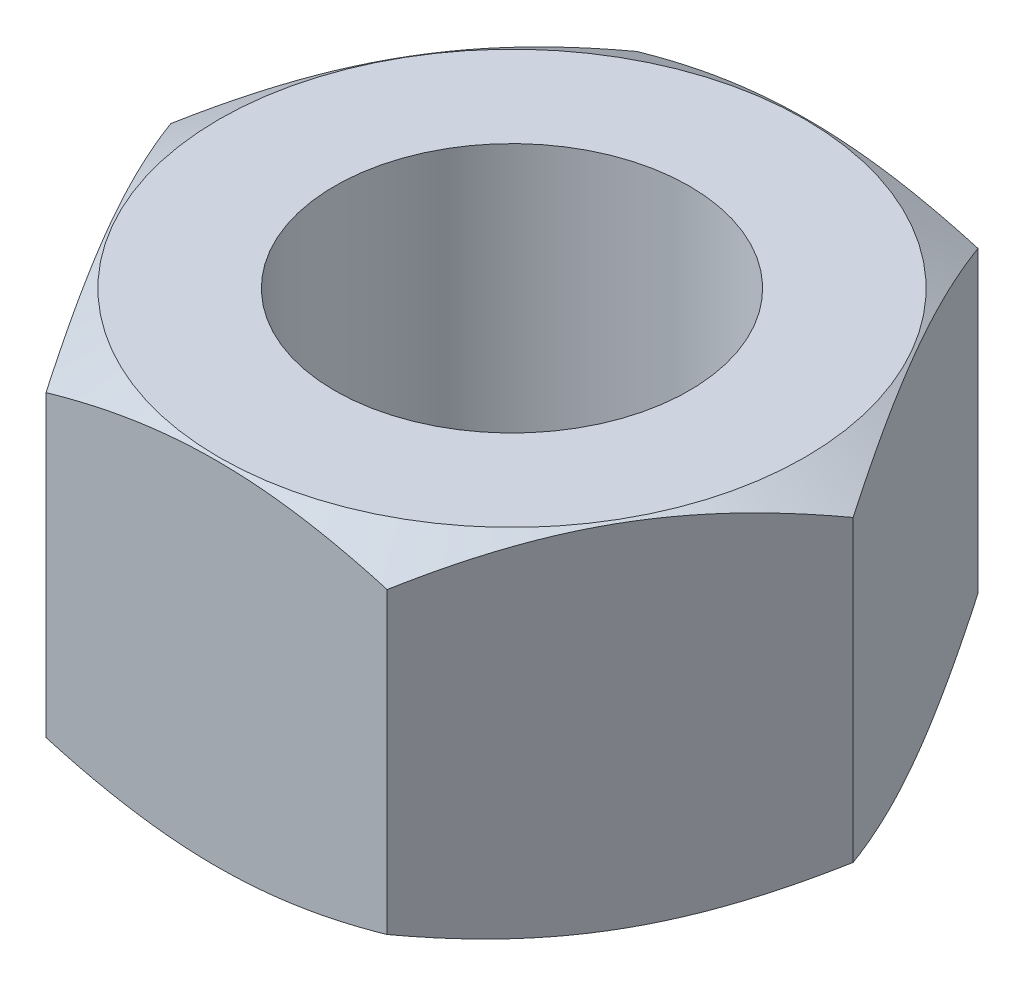
ISO-10303-21;
HEADER;
FILE_DESCRIPTION(('STEP AP214'),'2;1');
FILE_NAME('part.step','',(''),(''),'','','');
FILE_SCHEMA(('AUTOMOTIVE_DESIGN { 1 0 10303 214 1 1 1 1 }'));
ENDSEC;
DATA;
#1=APPLICATION_CONTEXT('core data for automotive mechanical design processes');
#2=APPLICATION_PROTOCOL_DEFINITION('international standard','automotive_design',2000,#1);
#3=PRODUCT_CONTEXT('',#1,'mechanical');
#4=PRODUCT('Part','Part','',(#3));
#5=PRODUCT_RELATED_PRODUCT_CATEGORY('part','',(#4));
#6=PRODUCT_DEFINITION_FORMATION('','',#4);
#7=PRODUCT_DEFINITION_CONTEXT('part definition',#1,'design');
#8=PRODUCT_DEFINITION('design','',#6,#7);
#9=PRODUCT_DEFINITION_SHAPE('','',#8);
#10=(LENGTH_UNIT() NAMED_UNIT(*) SI_UNIT(.MILLI.,.METRE.));
#11=(NAMED_UNIT(*) PLANE_ANGLE_UNIT() SI_UNIT($,.RADIAN.));
#12=(NAMED_UNIT(*) SI_UNIT($,.STERADIAN.) SOLID_ANGLE_UNIT());
#13=UNCERTAINTY_MEASURE_WITH_UNIT(LENGTH_MEASURE(1.E-05),#10,'distance_accuracy_value','');
#14=(GEOMETRIC_REPRESENTATION_CONTEXT(3) GLOBAL_UNCERTAINTY_ASSIGNED_CONTEXT((#13)) GLOBAL_UNIT_ASSIGNED_CONTEXT((#10,
#11,#12)) REPRESENTATION_CONTEXT('',''));
#15=CARTESIAN_POINT('',(0.,0.,0.));
#16=DIRECTION('',(0.,0.,1.));
#17=DIRECTION('',(1.,0.,0.));
#18=AXIS2_PLACEMENT_3D('',#15,#16,#17);
#19=CARTESIAN_POINT('',(0.,4.5,0.));
#20=DIRECTION('',(0.,1.,0.));
#21=DIRECTION('',(0.,0.,1.));
#22=AXIS2_PLACEMENT_3D('',#19,#20,#21);
#23=PLANE('',#22);
#24=CARTESIAN_POINT('',(0.,4.5,0.));
#25=DIRECTION('',(0.,1.,0.));
#26=DIRECTION('',(0.,0.,1.));
#27=AXIS2_PLACEMENT_3D('',#24,#25,#26);
#28=CIRCLE('',#27,7.4341359516973);
#29=CARTESIAN_POINT('',(0.,4.5,7.4341359516973));
#30=VERTEX_POINT('',#29);
#31=EDGE_CURVE('E204',#30,#30,#28,.F.);
#32=ORIENTED_EDGE('',*,*,#31,.F.);
#33=EDGE_LOOP('',(#32));
#34=FACE_BOUND('',#33,.T.);
#35=CARTESIAN_POINT('',(0.,4.5,0.));
#36=DIRECTION('',(0.,1.,0.));
#37=DIRECTION('',(0.,0.,1.));
#38=AXIS2_PLACEMENT_3D('',#35,#36,#37);
#39=CIRCLE('',#38,4.5);
#40=CARTESIAN_POINT('',(0.,4.5,4.5));
#41=VERTEX_POINT('',#40);
#42=EDGE_CURVE('E111',#41,#41,#39,.T.);
#43=ORIENTED_EDGE('',*,*,#42,.F.);
#44=EDGE_LOOP('',(#43));
#45=FACE_BOUND('',#44,.T.);
#46=ADVANCED_FACE('F33',(#34,#45),#23,.T.);
#47=CARTESIAN_POINT('',(0.,-4.5,0.));
#48=DIRECTION('',(0.,1.,0.));
#49=DIRECTION('',(0.,0.,1.));
#50=AXIS2_PLACEMENT_3D('',#47,#48,#49);
#51=PLANE('',#50);
#52=CARTESIAN_POINT('',(0.,-4.5,0.));
#53=DIRECTION('',(0.,1.,0.));
#54=DIRECTION('',(0.,0.,1.));
#55=AXIS2_PLACEMENT_3D('',#52,#53,#54);
#56=CIRCLE('',#55,7.4341359516973);
#57=CARTESIAN_POINT('',(0.,-4.5,7.4341359516973));
#58=VERTEX_POINT('',#57);
#59=EDGE_CURVE('E237',#58,#58,#56,.F.);
#60=ORIENTED_EDGE('',*,*,#59,.T.);
#61=EDGE_LOOP('',(#60));
#62=FACE_BOUND('',#61,.T.);
#63=CARTESIAN_POINT('',(0.,-4.5,0.));
#64=DIRECTION('',(0.,1.,0.));
#65=DIRECTION('',(0.,0.,1.));
#66=AXIS2_PLACEMENT_3D('',#63,#64,#65);
#67=CIRCLE('',#66,4.5);
#68=CARTESIAN_POINT('',(0.,-4.5,4.5));
#69=VERTEX_POINT('',#68);
#70=EDGE_CURVE('E207',#69,#69,#67,.T.);
#71=ORIENTED_EDGE('',*,*,#70,.T.);
#72=EDGE_LOOP('',(#71));
#73=FACE_BOUND('',#72,.T.);
#74=ADVANCED_FACE('F134',(#62,#73),#51,.F.);
#75=CARTESIAN_POINT('',(4.3301270189222,4.5,7.5));
#76=DIRECTION('',(-0.866025403784439,0.,-0.5));
#77=DIRECTION('',(-0.5,0.,0.866025403784439));
#78=AXIS2_PLACEMENT_3D('',#75,#76,#77);
#79=PLANE('',#78);
#80=DIRECTION('',(0.,-1.,0.));
#81=VECTOR('',#80,1.);
#82=CARTESIAN_POINT('',(4.3301270189222,4.5,7.5));
#83=LINE('',#82,#81);
#84=CARTESIAN_POINT('',(4.3301270189222,3.79210039290472,7.5));
#85=VERTEX_POINT('',#84);
#86=CARTESIAN_POINT('',(4.3301270189222,-3.79210039290472,7.5));
#87=VERTEX_POINT('',#86);
#88=EDGE_CURVE('E107',#85,#87,#83,.T.);
#89=ORIENTED_EDGE('',*,*,#88,.T.);
#90=CARTESIAN_POINT('',(4.33001154886836,-3.79203372490474,7.5002));
#91=CARTESIAN_POINT('',(4.42519256019198,-3.84697810293629,7.33534165247169));
#92=CARTESIAN_POINT('',(4.52072845228185,-3.89942888656319,7.16986863342562));
#93=CARTESIAN_POINT('',(4.71257608940913,-3.99865648145022,6.83757877860914));
#94=CARTESIAN_POINT('',(4.80888815017643,-4.04543084503664,6.67076139597852));
#95=CARTESIAN_POINT('',(5.099366398521,-4.17632119073135,6.16763831135212));
#96=CARTESIAN_POINT('',(5.29467919910788,-4.25077006730594,5.82934661736707));
#97=CARTESIAN_POINT('',(5.58696124946557,-4.3380700447163,5.32309925600715));
#98=CARTESIAN_POINT('',(5.68305719959877,-4.36293926066098,5.15665618797484));
#99=CARTESIAN_POINT('',(5.87568330162105,-4.40464125970851,4.8230179924083));
#100=CARTESIAN_POINT('',(5.97221341438525,-4.42147475286836,4.65582293264035));
#101=CARTESIAN_POINT('',(6.16544128734746,-4.44667629990832,4.32114243923135));
#102=CARTESIAN_POINT('',(6.26213873196775,-4.45505396096233,4.15365755218693));
#103=CARTESIAN_POINT('',(6.45561760093149,-4.46317319300757,3.81854232095076));
#104=CARTESIAN_POINT('',(6.55239902258814,-4.46291503079938,3.65091198141271));
#105=CARTESIAN_POINT('',(6.81754700863524,-4.45033736884589,3.19166219805456));
#106=CARTESIAN_POINT('',(6.98582677359289,-4.42922370630183,2.90019309526216));
#107=CARTESIAN_POINT('',(7.32126860628432,-4.36227279524708,2.31919079805659));
#108=CARTESIAN_POINT('',(7.48842949437092,-4.31641266451977,2.02965964685226));
#109=CARTESIAN_POINT('',(7.82454637240611,-4.20177591753428,1.44748813681388));
#110=CARTESIAN_POINT('',(7.99345995192916,-4.13251360961334,1.15492123499163));
#111=CARTESIAN_POINT('',(8.3287681694481,-3.9753162214056,0.574150366053476));
#112=CARTESIAN_POINT('',(8.49516710145045,-3.88741806481412,0.285938961500202));
#113=CARTESIAN_POINT('',(8.66036950789823,-3.79203372490474,-0.000199999999993936));
#114=B_SPLINE_CURVE_WITH_KNOTS('',3,(#90,#91,#92,#93,#94,#95,#96,#97,#98,#99,#100,#101,#102,
#103,#104,#105,#106,#107,#108,#109,#110,#111,#112,#113),.UNSPECIFIED.,.F.,.F.,(4,2,2,2,2,2,2,2,
2,2,2,4),(0.,0.594350768035412,1.1889569164522,2.38063993230779,2.96188692500078,
3.54308254771241,4.12361709366647,4.70413370423531,5.7147367557813,6.7262758828811,
7.76024925314079,8.79219281633468),.UNSPECIFIED.);
#115=CARTESIAN_POINT('',(8.66025403784439,-3.79210039290472,0.));
#116=VERTEX_POINT('',#115);
#117=EDGE_CURVE('E54',#87,#116,#114,.T.);
#118=ORIENTED_EDGE('',*,*,#117,.T.);
#119=DIRECTION('',(0.,-1.,0.));
#120=VECTOR('',#119,1.);
#121=CARTESIAN_POINT('',(8.66025403784439,4.5,0.));
#122=LINE('',#121,#120);
#123=CARTESIAN_POINT('',(8.66025403784439,3.79210039290472,0.));
#124=VERTEX_POINT('',#123);
#125=EDGE_CURVE('E120',#124,#116,#122,.T.);
#126=ORIENTED_EDGE('',*,*,#125,.F.);
#127=CARTESIAN_POINT('',(8.66036950789823,3.79203372490474,-0.000199999999994871));
#128=CARTESIAN_POINT('',(8.5651884965746,3.84697810293629,0.164658347528309));
#129=CARTESIAN_POINT('',(8.46965260448473,3.89942888656319,0.33013136657438));
#130=CARTESIAN_POINT('',(8.27780496735746,3.99865648145022,0.662421221390861));
#131=CARTESIAN_POINT('',(8.18149290659016,4.04543084503664,0.829238604021483));
#132=CARTESIAN_POINT('',(7.89101465824559,4.17632119073135,1.33236168864788));
#133=CARTESIAN_POINT('',(7.69570185765871,4.25077006730594,1.67065338263293));
#134=CARTESIAN_POINT('',(7.40341980730102,4.3380700447163,2.17690074399285));
#135=CARTESIAN_POINT('',(7.30732385716782,4.36293926066098,2.34334381202516));
#136=CARTESIAN_POINT('',(7.11469775514554,4.40464125970851,2.6769820075917));
#137=CARTESIAN_POINT('',(7.01816764238133,4.42147475286836,2.84417706735965));
#138=CARTESIAN_POINT('',(6.82493976941913,4.44667629990832,3.17885756076866));
#139=CARTESIAN_POINT('',(6.72824232479884,4.45505396096234,3.34634244781307));
#140=CARTESIAN_POINT('',(6.53476345583509,4.46317319300757,3.68145767904925));
#141=CARTESIAN_POINT('',(6.43798203417845,4.46291503079939,3.8490880185873));
#142=CARTESIAN_POINT('',(6.17283404813135,4.45033736884589,4.30833780194545));
#143=CARTESIAN_POINT('',(6.0045542831737,4.42922370630183,4.59980690473785));
#144=CARTESIAN_POINT('',(5.66911245048227,4.36227279524708,5.18080920194341));
#145=CARTESIAN_POINT('',(5.50195156239567,4.31641266451977,5.47034035314774));
#146=CARTESIAN_POINT('',(5.16583468436048,4.20177591753428,6.05251186318613));
#147=CARTESIAN_POINT('',(4.99692110483743,4.13251360961334,6.34507876500837));
#148=CARTESIAN_POINT('',(4.66161288731849,3.9753162214056,6.92584963394653));
#149=CARTESIAN_POINT('',(4.49521395531614,3.88741806481412,7.2140610384998));
#150=CARTESIAN_POINT('',(4.33001154886836,3.79203372490474,7.5002));
#151=B_SPLINE_CURVE_WITH_KNOTS('',3,(#127,#128,#129,#130,#131,#132,#133,#134,#135,#136,#137,
#138,#139,#140,#141,#142,#143,#144,#145,#146,#147,#148,#149,#150),.UNSPECIFIED.,.F.,.F.,(4,2,2,
2,2,2,2,2,2,2,2,4),(0.,0.594350768035412,1.1889569164522,2.38063993230779,2.96188692500078,
3.54308254771241,4.12361709366647,4.70413370423531,5.7147367557813,6.7262758828811,
7.76024925314079,8.79219281633468),.UNSPECIFIED.);
#152=EDGE_CURVE('E194',#124,#85,#151,.T.);
#153=ORIENTED_EDGE('',*,*,#152,.T.);
#154=EDGE_LOOP('',(#89,#118,#126,#153));
#155=FACE_BOUND('',#154,.T.);
#156=ADVANCED_FACE('F35',(#155),#79,.F.);
#157=CARTESIAN_POINT('',(8.66025403784439,4.5,0.));
#158=DIRECTION('',(-0.866025403784438,0.,0.5));
#159=DIRECTION('',(0.5,0.,0.866025403784438));
#160=AXIS2_PLACEMENT_3D('',#157,#158,#159);
#161=PLANE('',#160);
#162=ORIENTED_EDGE('',*,*,#125,.T.);
#163=CARTESIAN_POINT('',(8.66036950789823,-3.79203372490473,0.000200000000005225));
#164=CARTESIAN_POINT('',(8.56518849657461,-3.84697810293629,-0.164658347528298));
#165=CARTESIAN_POINT('',(8.46965260448474,-3.89942888656319,-0.330131366574369));
#166=CARTESIAN_POINT('',(8.27780496735746,-3.99865648145022,-0.66242122139085));
#167=CARTESIAN_POINT('',(8.18149290659016,-4.04543084503664,-0.829238604021472));
#168=CARTESIAN_POINT('',(7.89101465824559,-4.17632119073135,-1.33236168864787));
#169=CARTESIAN_POINT('',(7.69570185765871,-4.25077006730595,-1.67065338263292));
#170=CARTESIAN_POINT('',(7.40341980730102,-4.3380700447163,-2.17690074399284));
#171=CARTESIAN_POINT('',(7.30732385716782,-4.36293926066098,-2.34334381202515));
#172=CARTESIAN_POINT('',(7.11469775514554,-4.40464125970851,-2.67698200759169));
#173=CARTESIAN_POINT('',(7.01816764238133,-4.42147475286837,-2.84417706735964));
#174=CARTESIAN_POINT('',(6.82493976941913,-4.44667629990832,-3.17885756076865));
#175=CARTESIAN_POINT('',(6.72824232479884,-4.45505396096234,-3.34634244781306));
#176=CARTESIAN_POINT('',(6.53476345583509,-4.46317319300758,-3.68145767904924));
#177=CARTESIAN_POINT('',(6.43798203417845,-4.46291503079939,-3.84908801858729));
#178=CARTESIAN_POINT('',(6.17283404813135,-4.4503373688459,-4.30833780194544));
#179=CARTESIAN_POINT('',(6.00455428317369,-4.42922370630183,-4.59980690473784));
#180=CARTESIAN_POINT('',(5.66911245048227,-4.36227279524709,-5.1808092019434));
#181=CARTESIAN_POINT('',(5.50195156239567,-4.31641266451978,-5.47034035314773));
#182=CARTESIAN_POINT('',(5.16583468436047,-4.20177591753428,-6.05251186318612));
#183=CARTESIAN_POINT('',(4.99692110483742,-4.13251360961334,-6.34507876500837));
#184=CARTESIAN_POINT('',(4.66161288731849,-3.9753162214056,-6.92584963394653));
#185=CARTESIAN_POINT('',(4.49521395531613,-3.88741806481413,-7.2140610384998));
#186=CARTESIAN_POINT('',(4.33001154886835,-3.79203372490474,-7.5002));
#187=B_SPLINE_CURVE_WITH_KNOTS('',3,(#163,#164,#165,#166,#167,#168,#169,#170,#171,#172,#173,
#174,#175,#176,#177,#178,#179,#180,#181,#182,#183,#184,#185,#186),.UNSPECIFIED.,.F.,.F.,(4,2,2,
2,2,2,2,2,2,2,2,4),(0.,0.594350768035412,1.1889569164522,2.38063993230779,2.96188692500078,
3.54308254771242,4.12361709366647,4.70413370423531,5.71473675578131,6.7262758828811,
7.7602492531408,8.7921928163347),.UNSPECIFIED.);
#188=CARTESIAN_POINT('',(4.33012701892219,-3.79210039290472,-7.5));
#189=VERTEX_POINT('',#188);
#190=EDGE_CURVE('E171',#116,#189,#187,.T.);
#191=ORIENTED_EDGE('',*,*,#190,.T.);
#192=DIRECTION('',(0.,-1.,0.));
#193=VECTOR('',#192,1.);
#194=CARTESIAN_POINT('',(4.33012701892219,4.5,-7.5));
#195=LINE('',#194,#193);
#196=CARTESIAN_POINT('',(4.33012701892219,3.79210039290472,-7.5));
#197=VERTEX_POINT('',#196);
#198=EDGE_CURVE('E117',#197,#189,#195,.T.);
#199=ORIENTED_EDGE('',*,*,#198,.F.);
#200=CARTESIAN_POINT('',(4.33001154886835,3.79203372490474,-7.5002));
#201=CARTESIAN_POINT('',(4.42519256019197,3.84697810293629,-7.3353416524717));
#202=CARTESIAN_POINT('',(4.52072845228184,3.8994288865632,-7.16986863342563));
#203=CARTESIAN_POINT('',(4.71257608940912,3.99865648145022,-6.83757877860914));
#204=CARTESIAN_POINT('',(4.80888815017642,4.04543084503664,-6.67076139597852));
#205=CARTESIAN_POINT('',(5.09936639852099,4.17632119073135,-6.16763831135212));
#206=CARTESIAN_POINT('',(5.29467919910787,4.25077006730595,-5.82934661736707));
#207=CARTESIAN_POINT('',(5.58696124946556,4.33807004471631,-5.32309925600715));
#208=CARTESIAN_POINT('',(5.68305719959876,4.36293926066098,-5.15665618797484));
#209=CARTESIAN_POINT('',(5.87568330162104,4.40464125970851,-4.82301799240831));
#210=CARTESIAN_POINT('',(5.97221341438524,4.42147475286837,-4.65582293264035));
#211=CARTESIAN_POINT('',(6.16544128734745,4.44667629990833,-4.32114243923135));
#212=CARTESIAN_POINT('',(6.26213873196774,4.45505396096234,-4.15365755218693));
#213=CARTESIAN_POINT('',(6.45561760093148,4.46317319300758,-3.81854232095076));
#214=CARTESIAN_POINT('',(6.55239902258813,4.46291503079939,-3.65091198141271));
#215=CARTESIAN_POINT('',(6.81754700863523,4.4503373688459,-3.19166219805456));
#216=CARTESIAN_POINT('',(6.98582677359288,4.42922370630183,-2.90019309526216));
#217=CARTESIAN_POINT('',(7.32126860628431,4.36227279524709,-2.31919079805659));
#218=CARTESIAN_POINT('',(7.48842949437091,4.31641266451978,-2.02965964685226));
#219=CARTESIAN_POINT('',(7.82454637240611,4.20177591753428,-1.44748813681387));
#220=CARTESIAN_POINT('',(7.99345995192916,4.13251360961334,-1.15492123499162));
#221=CARTESIAN_POINT('',(8.32876816944809,3.9753162214056,-0.574150366053468));
#222=CARTESIAN_POINT('',(8.49516710145045,3.88741806481412,-0.285938961500192));
#223=CARTESIAN_POINT('',(8.66036950789823,3.79203372490474,0.000200000000005035));
#224=B_SPLINE_CURVE_WITH_KNOTS('',3,(#200,#201,#202,#203,#204,#205,#206,#207,#208,#209,#210,
#211,#212,#213,#214,#215,#216,#217,#218,#219,#220,#221,#222,#223),.UNSPECIFIED.,.F.,.F.,(4,2,2,
2,2,2,2,2,2,2,2,4),(0.,0.594350768035412,1.1889569164522,2.38063993230779,2.96188692500078,
3.54308254771241,4.12361709366647,4.70413370423531,5.7147367557813,6.7262758828811,
7.7602492531408,8.7921928163347),.UNSPECIFIED.);
#225=EDGE_CURVE('E187',#197,#124,#224,.T.);
#226=ORIENTED_EDGE('',*,*,#225,.T.);
#227=EDGE_LOOP('',(#162,#191,#199,#226));
#228=FACE_BOUND('',#227,.T.);
#229=ADVANCED_FACE('F179',(#228),#161,.F.);
#230=CARTESIAN_POINT('',(4.33012701892219,4.5,-7.5));
#231=DIRECTION('',(0.,0.,1.));
#232=DIRECTION('',(1.,0.,0.));
#233=AXIS2_PLACEMENT_3D('',#230,#231,#232);
#234=PLANE('',#233);
#235=ORIENTED_EDGE('',*,*,#198,.T.);
#236=CARTESIAN_POINT('',(-11.5395924058814,-0.846195936438404,-7.5));
#237=CARTESIAN_POINT('',(-11.2127769642372,-1.00435992916208,-7.5));
#238=CARTESIAN_POINT('',(-10.8852013735051,-1.16098061428477,-7.5));
#239=CARTESIAN_POINT('',(-10.2281252758828,-1.47026548030183,-7.5));
#240=CARTESIAN_POINT('',(-9.89862446699821,-1.62292901887506,-7.5));
#241=CARTESIAN_POINT('',(-9.23555117525074,-1.92421750059593,-7.5));
#242=CARTESIAN_POINT('',(-8.90196622891297,-2.07281511097907,-7.5));
#243=CARTESIAN_POINT('',(-8.23211087262991,-2.36380543965907,-7.5));
#244=CARTESIAN_POINT('',(-7.89584059326197,-2.50619845751339,-7.5));
#245=CARTESIAN_POINT('',(-7.20958210730869,-2.78744038983469,-7.5));
#246=CARTESIAN_POINT('',(-6.85949204741581,-2.92604216989549,-7.5));
#247=CARTESIAN_POINT('',(-6.15518322737085,-3.19253212483412,-7.5));
#248=CARTESIAN_POINT('',(-5.80096400412197,-3.32041908458772,-7.5));
#249=CARTESIAN_POINT('',(-5.08852224391839,-3.56205426578386,-7.5));
#250=CARTESIAN_POINT('',(-4.73030980043322,-3.67583192223676,-7.5));
#251=CARTESIAN_POINT('',(-4.00876097959616,-3.8855389558614,-7.5));
#252=CARTESIAN_POINT('',(-3.64542628466288,-3.98147405301494,-7.5));
#253=CARTESIAN_POINT('',(-2.91536601033844,-4.15031982241968,-7.5));
#254=CARTESIAN_POINT('',(-2.54866930784728,-4.22335194276098,-7.5));
#255=CARTESIAN_POINT('',(-1.99535958061554,-4.3125162024176,-7.5));
#256=CARTESIAN_POINT('',(-1.81036456926675,-4.33884154012838,-7.5));
#257=CARTESIAN_POINT('',(-1.43948655345895,-4.38417925815019,-7.5));
#258=CARTESIAN_POINT('',(-1.25360363614891,-4.40319234181923,-7.5));
#259=CARTESIAN_POINT('',(-0.883586273494876,-4.43329302435465,-7.5));
#260=CARTESIAN_POINT('',(-0.699459845505899,-4.44447881264385,-7.5));
#261=CARTESIAN_POINT('',(-0.33089933388193,-4.45906070729381,-7.5));
#262=CARTESIAN_POINT('',(-0.146465255285703,-4.46245694000396,-7.5));
#263=CARTESIAN_POINT('',(0.222381927440417,-4.46137889311918,-7.5));
#264=CARTESIAN_POINT('',(0.406795031436095,-4.45690456571466,-7.5));
#265=CARTESIAN_POINT('',(0.775271642923434,-4.44019310454552,-7.5));
#266=CARTESIAN_POINT('',(0.959335131699971,-4.42795556633876,-7.5));
#267=CARTESIAN_POINT('',(1.40452016722755,-4.38922457185199,-7.5));
#268=CARTESIAN_POINT('',(1.66531438699297,-4.35889107931952,-7.5));
#269=CARTESIAN_POINT('',(2.18489408576868,-4.28431600218544,-7.5));
#270=CARTESIAN_POINT('',(2.44367927487946,-4.24007244725284,-7.5));
#271=CARTESIAN_POINT('',(3.2167670857175,-4.08882909832201,-7.5));
#272=CARTESIAN_POINT('',(3.72749758329527,-3.9633465312742,-7.5));
#273=CARTESIAN_POINT('',(4.49104327969545,-3.74667709173858,-7.5));
#274=CARTESIAN_POINT('',(4.74784210933529,-3.66872900781551,-7.5));
#275=CARTESIAN_POINT('',(5.25894422295974,-3.50496790450674,-7.5));
#276=CARTESIAN_POINT('',(5.5132474909373,-3.41915483470991,-7.5));
#277=CARTESIAN_POINT('',(6.01944286002732,-3.24102125477352,-7.5));
#278=CARTESIAN_POINT('',(6.27133577768172,-3.14870304388596,-7.5));
#279=CARTESIAN_POINT('',(6.77305045823042,-2.95862226308785,-7.5));
#280=CARTESIAN_POINT('',(7.02287224113362,-2.86085974584442,-7.5));
#281=CARTESIAN_POINT('',(7.59417450290957,-2.63126038399901,-7.5));
#282=CARTESIAN_POINT('',(7.91503538642881,-2.49788506028777,-7.5));
#283=CARTESIAN_POINT('',(8.55417556394399,-2.22507020094293,-7.5));
#284=CARTESIAN_POINT('',(8.87245472675068,-2.08563035940515,-7.5));
#285=CARTESIAN_POINT('',(9.50688911121455,-1.8018520856645,-7.5));
#286=CARTESIAN_POINT('',(9.82304391592479,-1.6575127236448,-7.5));
#287=CARTESIAN_POINT('',(10.4535087877737,-1.36488197517741,-7.5));
#288=CARTESIAN_POINT('',(10.7678188847199,-1.21659065280264,-7.5));
#289=CARTESIAN_POINT('',(11.395171445629,-0.916632382376871,-7.5));
#290=CARTESIAN_POINT('',(11.7082125042594,-0.764962499660067,-7.5));
#291=CARTESIAN_POINT('',(12.3329778714164,-0.458932312232355,-7.5));
#292=CARTESIAN_POINT('',(12.644702168638,-0.304571984481096,-7.5));
#293=CARTESIAN_POINT('',(13.5782167134934,0.161861064968362,-7.5));
#294=CARTESIAN_POINT('',(14.1983359239781,0.477279737819667,-7.5));
#295=CARTESIAN_POINT('',(15.1015948839471,0.942577635458164,-7.5));
#296=CARTESIAN_POINT('',(15.3860321019372,1.08995381902805,-7.5));
#297=CARTESIAN_POINT('',(15.9542869447692,1.38588525845685,-7.5));
#298=CARTESIAN_POINT('',(16.238104580233,1.53444049389677,-7.5));
#299=CARTESIAN_POINT('',(17.0887723203144,1.98165026042697,-7.5));
#300=CARTESIAN_POINT('',(17.6548162949906,2.28183802298298,-7.5));
#301=CARTESIAN_POINT('',(18.7839520512125,2.8846669586119,-7.5));
#302=CARTESIAN_POINT('',(19.3470476124426,3.18730106478019,-7.5));
#303=CARTESIAN_POINT('',(20.471864823661,3.79504578027235,-7.5));
#304=CARTESIAN_POINT('',(21.0335865411291,4.10015626464935,-7.5));
#305=CARTESIAN_POINT('',(21.594797047145,4.40619822860168,-7.5));
#306=B_SPLINE_CURVE_WITH_KNOTS('',3,(#236,#237,#238,#239,#240,#241,#242,#243,#244,#245,#246,
#247,#248,#249,#250,#251,#252,#253,#254,#255,#256,#257,#258,#259,#260,#261,#262,#263,#264,#265,
#266,#267,#268,#269,#270,#271,#272,#273,#274,#275,#276,#277,#278,#279,#280,#281,#282,#283,#284,
#285,#286,#287,#288,#289,#290,#291,#292,#293,#294,#295,#296,#297,#298,#299,#300,#301,#302,#303,
#304,#305),.UNSPECIFIED.,.F.,.F.,(4,2,2,2,2,2,2,2,2,2,2,2,2,2,2,2,2,2,2,2,2,2,2,2,2,2,2,2,2,2,2,
2,2,2,4),(0.,1.08924175143649,2.17865921444465,3.2741639744668,4.36961578482893,
5.49906443786425,6.6286410041974,7.75581990553287,8.88263682974859,10.003373366933,
10.5638276698733,11.1242280498134,11.6774659778012,12.2306949320075,12.783927246806,
13.337188385869,14.1243987026943,14.9117205764773,16.4872777313753,17.2923185532113,
18.0973645353688,18.9021273864406,19.7068824537535,20.7492331837171,21.7916365526693,
22.8342388642404,23.8768242824306,24.9203536359842,25.9638919304776,28.0510107755432,
29.0120605225308,29.9730936620707,31.8952307249398,33.8130293296857,35.7307317651679),.UNSPECIFIED.);
#307=CARTESIAN_POINT('',(-4.33012701892219,-3.79210039290472,-7.5));
#308=VERTEX_POINT('',#307);
#309=EDGE_CURVE('E166',#189,#308,#306,.F.);
#310=ORIENTED_EDGE('',*,*,#309,.T.);
#311=DIRECTION('',(0.,-1.,0.));
#312=VECTOR('',#311,1.);
#313=CARTESIAN_POINT('',(-4.33012701892219,4.5,-7.5));
#314=LINE('',#313,#312);
#315=CARTESIAN_POINT('',(-4.33012701892219,3.79210039290472,-7.5));
#316=VERTEX_POINT('',#315);
#317=EDGE_CURVE('E109',#316,#308,#314,.T.);
#318=ORIENTED_EDGE('',*,*,#317,.F.);
#319=CARTESIAN_POINT('',(-11.5395924058814,0.846195936438405,-7.5));
#320=CARTESIAN_POINT('',(-11.2127769642372,1.00435992916208,-7.5));
#321=CARTESIAN_POINT('',(-10.8852013735051,1.16098061428477,-7.5));
#322=CARTESIAN_POINT('',(-10.2281252758828,1.47026548030183,-7.5));
#323=CARTESIAN_POINT('',(-9.8986244669982,1.62292901887507,-7.5));
#324=CARTESIAN_POINT('',(-9.23555117525074,1.92421750059593,-7.5));
#325=CARTESIAN_POINT('',(-8.90196622891296,2.07281511097907,-7.5));
#326=CARTESIAN_POINT('',(-8.2321108726299,2.36380543965907,-7.5));
#327=CARTESIAN_POINT('',(-7.89584059326197,2.50619845751339,-7.5));
#328=CARTESIAN_POINT('',(-7.20958210730868,2.78744038983469,-7.5));
#329=CARTESIAN_POINT('',(-6.85949204741581,2.92604216989549,-7.5));
#330=CARTESIAN_POINT('',(-6.15518322737085,3.19253212483412,-7.5));
#331=CARTESIAN_POINT('',(-5.80096400412197,3.32041908458772,-7.5));
#332=CARTESIAN_POINT('',(-5.08852224391839,3.56205426578386,-7.5));
#333=CARTESIAN_POINT('',(-4.73030980043322,3.67583192223676,-7.5));
#334=CARTESIAN_POINT('',(-4.00876097959616,3.8855389558614,-7.5));
#335=CARTESIAN_POINT('',(-3.64542628466288,3.98147405301494,-7.5));
#336=CARTESIAN_POINT('',(-2.91536601033844,4.15031982241968,-7.5));
#337=CARTESIAN_POINT('',(-2.54866930784728,4.22335194276099,-7.5));
#338=CARTESIAN_POINT('',(-1.99535958061554,4.3125162024176,-7.5));
#339=CARTESIAN_POINT('',(-1.81036456926675,4.33884154012838,-7.5));
#340=CARTESIAN_POINT('',(-1.43948655345894,4.38417925815019,-7.5));
#341=CARTESIAN_POINT('',(-1.25360363614891,4.40319234181923,-7.5));
#342=CARTESIAN_POINT('',(-0.883586273494875,4.43329302435465,-7.5));
#343=CARTESIAN_POINT('',(-0.699459845505898,4.44447881264385,-7.5));
#344=CARTESIAN_POINT('',(-0.330899333881929,4.45906070729381,-7.5));
#345=CARTESIAN_POINT('',(-0.146465255285703,4.46245694000396,-7.5));
#346=CARTESIAN_POINT('',(0.222381927440416,4.46137889311918,-7.5));
#347=CARTESIAN_POINT('',(0.406795031436094,4.45690456571466,-7.5));
#348=CARTESIAN_POINT('',(0.775271642923433,4.44019310454552,-7.5));
#349=CARTESIAN_POINT('',(0.95933513169997,4.42795556633876,-7.5));
#350=CARTESIAN_POINT('',(1.40452016722755,4.38922457185199,-7.5));
#351=CARTESIAN_POINT('',(1.66531438699297,4.35889107931952,-7.5));
#352=CARTESIAN_POINT('',(2.18489408576868,4.28431600218545,-7.5));
#353=CARTESIAN_POINT('',(2.44367927487945,4.24007244725284,-7.5));
#354=CARTESIAN_POINT('',(3.2167670857175,4.08882909832201,-7.5));
#355=CARTESIAN_POINT('',(3.72749758329527,3.9633465312742,-7.5));
#356=CARTESIAN_POINT('',(4.49104327969544,3.74667709173858,-7.5));
#357=CARTESIAN_POINT('',(4.74784210933529,3.66872900781551,-7.5));
#358=CARTESIAN_POINT('',(5.25894422295973,3.50496790450674,-7.5));
#359=CARTESIAN_POINT('',(5.5132474909373,3.41915483470991,-7.5));
#360=CARTESIAN_POINT('',(6.01944286002732,3.24102125477353,-7.5));
#361=CARTESIAN_POINT('',(6.27133577768172,3.14870304388596,-7.5));
#362=CARTESIAN_POINT('',(6.77305045823042,2.95862226308785,-7.5));
#363=CARTESIAN_POINT('',(7.02287224113361,2.86085974584443,-7.5));
#364=CARTESIAN_POINT('',(7.59417450290956,2.63126038399901,-7.5));
#365=CARTESIAN_POINT('',(7.91503538642881,2.49788506028777,-7.5));
#366=CARTESIAN_POINT('',(8.55417556394399,2.22507020094293,-7.5));
#367=CARTESIAN_POINT('',(8.87245472675068,2.08563035940516,-7.5));
#368=CARTESIAN_POINT('',(9.50688911121454,1.8018520856645,-7.5));
#369=CARTESIAN_POINT('',(9.82304391592478,1.6575127236448,-7.5));
#370=CARTESIAN_POINT('',(10.4535087877737,1.36488197517742,-7.5));
#371=CARTESIAN_POINT('',(10.7678188847199,1.21659065280265,-7.5));
#372=CARTESIAN_POINT('',(11.395171445629,0.916632382376875,-7.5));
#373=CARTESIAN_POINT('',(11.7082125042594,0.764962499660071,-7.5));
#374=CARTESIAN_POINT('',(12.3329778714164,0.458932312232359,-7.5));
#375=CARTESIAN_POINT('',(12.644702168638,0.3045719844811,-7.5));
#376=CARTESIAN_POINT('',(13.5782167134934,-0.161861064968358,-7.5));
#377=CARTESIAN_POINT('',(14.1983359239781,-0.477279737819662,-7.5));
#378=CARTESIAN_POINT('',(15.1015948839471,-0.942577635458158,-7.5));
#379=CARTESIAN_POINT('',(15.3860321019372,-1.08995381902804,-7.5));
#380=CARTESIAN_POINT('',(15.9542869447692,-1.38588525845685,-7.5));
#381=CARTESIAN_POINT('',(16.238104580233,-1.53444049389676,-7.5));
#382=CARTESIAN_POINT('',(17.0887723203144,-1.98165026042697,-7.5));
#383=CARTESIAN_POINT('',(17.6548162949906,-2.28183802298297,-7.5));
#384=CARTESIAN_POINT('',(18.7839520512125,-2.88466695861189,-7.5));
#385=CARTESIAN_POINT('',(19.3470476124426,-3.18730106478018,-7.5));
#386=CARTESIAN_POINT('',(20.471864823661,-3.79504578027235,-7.5));
#387=CARTESIAN_POINT('',(21.0335865411291,-4.10015626464935,-7.5));
#388=CARTESIAN_POINT('',(21.594797047145,-4.40619822860167,-7.5));
#389=B_SPLINE_CURVE_WITH_KNOTS('',3,(#319,#320,#321,#322,#323,#324,#325,#326,#327,#328,#329,
#330,#331,#332,#333,#334,#335,#336,#337,#338,#339,#340,#341,#342,#343,#344,#345,#346,#347,#348,
#349,#350,#351,#352,#353,#354,#355,#356,#357,#358,#359,#360,#361,#362,#363,#364,#365,#366,#367,
#368,#369,#370,#371,#372,#373,#374,#375,#376,#377,#378,#379,#380,#381,#382,#383,#384,#385,#386,
#387,#388),.UNSPECIFIED.,.F.,.F.,(4,2,2,2,2,2,2,2,2,2,2,2,2,2,2,2,2,2,2,2,2,2,2,2,2,2,2,2,2,2,2,
2,2,2,4),(0.,1.08924175143649,2.17865921444465,3.2741639744668,4.36961578482893,
5.49906443786425,6.6286410041974,7.75581990553286,8.88263682974859,10.003373366933,
10.5638276698733,11.1242280498134,11.6774659778012,12.2306949320075,12.783927246806,
13.337188385869,14.1243987026943,14.9117205764773,16.4872777313753,17.2923185532113,
18.0973645353688,18.9021273864406,19.7068824537535,20.7492331837171,21.7916365526693,
22.8342388642404,23.8768242824306,24.9203536359842,25.9638919304776,28.0510107755431,
29.0120605225308,29.9730936620707,31.8952307249398,33.8130293296857,35.7307317651679),.UNSPECIFIED.);
#390=EDGE_CURVE('E195',#316,#197,#389,.T.);
#391=ORIENTED_EDGE('',*,*,#390,.T.);
#392=EDGE_LOOP('',(#235,#310,#318,#391));
#393=FACE_BOUND('',#392,.T.);
#394=ADVANCED_FACE('F182',(#393),#234,.F.);
#395=CARTESIAN_POINT('',(-4.33012701892219,4.5,-7.5));
#396=DIRECTION('',(0.866025403784438,0.,0.5));
#397=DIRECTION('',(0.5,0.,-0.866025403784439));
#398=AXIS2_PLACEMENT_3D('',#395,#396,#397);
#399=PLANE('',#398);
#400=ORIENTED_EDGE('',*,*,#317,.T.);
#401=CARTESIAN_POINT('',(-4.33001154886835,-3.79203372490474,-7.5002));
#402=CARTESIAN_POINT('',(-4.42519256019198,-3.84697810293629,-7.3353416524717));
#403=CARTESIAN_POINT('',(-4.52072845228185,-3.89942888656319,-7.16986863342563));
#404=CARTESIAN_POINT('',(-4.71257608940912,-3.99865648145022,-6.83757877860915));
#405=CARTESIAN_POINT('',(-4.80888815017642,-4.04543084503664,-6.67076139597852));
#406=CARTESIAN_POINT('',(-5.09936639852099,-4.17632119073135,-6.16763831135212));
#407=CARTESIAN_POINT('',(-5.29467919910787,-4.25077006730595,-5.82934661736707));
#408=CARTESIAN_POINT('',(-5.58696124946556,-4.3380700447163,-5.32309925600715));
#409=CARTESIAN_POINT('',(-5.68305719959876,-4.36293926066098,-5.15665618797484));
#410=CARTESIAN_POINT('',(-5.87568330162104,-4.40464125970851,-4.82301799240831));
#411=CARTESIAN_POINT('',(-5.97221341438525,-4.42147475286837,-4.65582293264035));
#412=CARTESIAN_POINT('',(-6.16544128734745,-4.44667629990832,-4.32114243923135));
#413=CARTESIAN_POINT('',(-6.26213873196774,-4.45505396096234,-4.15365755218693));
#414=CARTESIAN_POINT('',(-6.45561760093149,-4.46317319300757,-3.81854232095076));
#415=CARTESIAN_POINT('',(-6.55239902258813,-4.46291503079939,-3.65091198141271));
#416=CARTESIAN_POINT('',(-6.81754700863523,-4.4503373688459,-3.19166219805456));
#417=CARTESIAN_POINT('',(-6.98582677359289,-4.42922370630183,-2.90019309526216));
#418=CARTESIAN_POINT('',(-7.32126860628431,-4.36227279524709,-2.31919079805659));
#419=CARTESIAN_POINT('',(-7.48842949437091,-4.31641266451978,-2.02965964685226));
#420=CARTESIAN_POINT('',(-7.82454637240611,-4.20177591753428,-1.44748813681388));
#421=CARTESIAN_POINT('',(-7.99345995192916,-4.13251360961334,-1.15492123499163));
#422=CARTESIAN_POINT('',(-8.32876816944809,-3.9753162214056,-0.574150366053472));
#423=CARTESIAN_POINT('',(-8.49516710145045,-3.88741806481412,-0.285938961500197));
#424=CARTESIAN_POINT('',(-8.66036950789822,-3.79203372490474,0.000199999999998916));
#425=B_SPLINE_CURVE_WITH_KNOTS('',3,(#401,#402,#403,#404,#405,#406,#407,#408,#409,#410,#411,
#412,#413,#414,#415,#416,#417,#418,#419,#420,#421,#422,#423,#424),.UNSPECIFIED.,.F.,.F.,(4,2,2,
2,2,2,2,2,2,2,2,4),(0.,0.594350768035411,1.1889569164522,2.38063993230779,2.96188692500078,
3.54308254771241,4.12361709366647,4.70413370423531,5.7147367557813,6.7262758828811,
7.7602492531408,8.79219281633469),.UNSPECIFIED.);
#426=CARTESIAN_POINT('',(-8.66025403784439,-3.79210039290472,0.));
#427=VERTEX_POINT('',#426);
#428=EDGE_CURVE('E104',#308,#427,#425,.T.);
#429=ORIENTED_EDGE('',*,*,#428,.T.);
#430=DIRECTION('',(0.,-1.,0.));
#431=VECTOR('',#430,1.);
#432=CARTESIAN_POINT('',(-8.66025403784439,4.5,0.));
#433=LINE('',#432,#431);
#434=CARTESIAN_POINT('',(-8.66025403784439,3.79210039290472,0.));
#435=VERTEX_POINT('',#434);
#436=EDGE_CURVE('E103',#435,#427,#433,.T.);
#437=ORIENTED_EDGE('',*,*,#436,.F.);
#438=CARTESIAN_POINT('',(-8.66036950789822,3.79203372490474,0.000199999999999369));
#439=CARTESIAN_POINT('',(-8.5651884965746,3.84697810293629,-0.164658347528305));
#440=CARTESIAN_POINT('',(-8.46965260448473,3.89942888656319,-0.330131366574375));
#441=CARTESIAN_POINT('',(-8.27780496735746,3.99865648145022,-0.662421221390857));
#442=CARTESIAN_POINT('',(-8.18149290659016,4.04543084503664,-0.829238604021478));
#443=CARTESIAN_POINT('',(-7.89101465824559,4.17632119073135,-1.33236168864788));
#444=CARTESIAN_POINT('',(-7.69570185765871,4.25077006730595,-1.67065338263293));
#445=CARTESIAN_POINT('',(-7.40341980730102,4.3380700447163,-2.17690074399285));
#446=CARTESIAN_POINT('',(-7.30732385716782,4.36293926066098,-2.34334381202516));
#447=CARTESIAN_POINT('',(-7.11469775514554,4.40464125970851,-2.67698200759169));
#448=CARTESIAN_POINT('',(-7.01816764238133,4.42147475286837,-2.84417706735965));
#449=CARTESIAN_POINT('',(-6.82493976941913,4.44667629990832,-3.17885756076865));
#450=CARTESIAN_POINT('',(-6.72824232479884,4.45505396096234,-3.34634244781307));
#451=CARTESIAN_POINT('',(-6.53476345583509,4.46317319300758,-3.68145767904924));
#452=CARTESIAN_POINT('',(-6.43798203417845,4.46291503079939,-3.84908801858729));
#453=CARTESIAN_POINT('',(-6.17283404813135,4.4503373688459,-4.30833780194544));
#454=CARTESIAN_POINT('',(-6.00455428317369,4.42922370630183,-4.59980690473784));
#455=CARTESIAN_POINT('',(-5.66911245048227,4.36227279524709,-5.18080920194341));
#456=CARTESIAN_POINT('',(-5.50195156239567,4.31641266451978,-5.47034035314774));
#457=CARTESIAN_POINT('',(-5.16583468436047,4.20177591753428,-6.05251186318613));
#458=CARTESIAN_POINT('',(-4.99692110483742,4.13251360961334,-6.34507876500837));
#459=CARTESIAN_POINT('',(-4.66161288731849,3.9753162214056,-6.92584963394653));
#460=CARTESIAN_POINT('',(-4.49521395531613,3.88741806481412,-7.2140610384998));
#461=CARTESIAN_POINT('',(-4.33001154886835,3.79203372490474,-7.5002));
#462=B_SPLINE_CURVE_WITH_KNOTS('',3,(#438,#439,#440,#441,#442,#443,#444,#445,#446,#447,#448,
#449,#450,#451,#452,#453,#454,#455,#456,#457,#458,#459,#460,#461),.UNSPECIFIED.,.F.,.F.,(4,2,2,
2,2,2,2,2,2,2,2,4),(0.,0.594350768035412,1.1889569164522,2.38063993230779,2.96188692500078,
3.54308254771241,4.12361709366647,4.70413370423531,5.7147367557813,6.7262758828811,
7.76024925314079,8.79219281633469),.UNSPECIFIED.);
#463=EDGE_CURVE('E235',#435,#316,#462,.T.);
#464=ORIENTED_EDGE('',*,*,#463,.T.);
#465=EDGE_LOOP('',(#400,#429,#437,#464));
#466=FACE_BOUND('',#465,.T.);
#467=ADVANCED_FACE('F140',(#466),#399,.F.);
#468=CARTESIAN_POINT('',(-8.66025403784439,4.5,0.));
#469=DIRECTION('',(0.866025403784439,0.,-0.5));
#470=DIRECTION('',(-0.5,0.,-0.866025403784439));
#471=AXIS2_PLACEMENT_3D('',#468,#469,#470);
#472=PLANE('',#471);
#473=ORIENTED_EDGE('',*,*,#436,.T.);
#474=CARTESIAN_POINT('',(-8.66036950789822,-3.79203372490474,-0.000200000000000836));
#475=CARTESIAN_POINT('',(-8.5651884965746,-3.84697810293629,0.164658347528303));
#476=CARTESIAN_POINT('',(-8.46965260448473,-3.89942888656319,0.330131366574374));
#477=CARTESIAN_POINT('',(-8.27780496735746,-3.99865648145022,0.662421221390855));
#478=CARTESIAN_POINT('',(-8.18149290659016,-4.04543084503664,0.829238604021477));
#479=CARTESIAN_POINT('',(-7.89101465824559,-4.17632119073135,1.33236168864788));
#480=CARTESIAN_POINT('',(-7.69570185765871,-4.25077006730595,1.67065338263293));
#481=CARTESIAN_POINT('',(-7.40341980730102,-4.3380700447163,2.17690074399285));
#482=CARTESIAN_POINT('',(-7.30732385716782,-4.36293926066098,2.34334381202516));
#483=CARTESIAN_POINT('',(-7.11469775514554,-4.40464125970851,2.67698200759169));
#484=CARTESIAN_POINT('',(-7.01816764238133,-4.42147475286837,2.84417706735965));
#485=CARTESIAN_POINT('',(-6.82493976941913,-4.44667629990832,3.17885756076865));
#486=CARTESIAN_POINT('',(-6.72824232479884,-4.45505396096234,3.34634244781307));
#487=CARTESIAN_POINT('',(-6.53476345583509,-4.46317319300757,3.68145767904924));
#488=CARTESIAN_POINT('',(-6.43798203417845,-4.46291503079939,3.84908801858729));
#489=CARTESIAN_POINT('',(-6.17283404813135,-4.4503373688459,4.30833780194544));
#490=CARTESIAN_POINT('',(-6.00455428317369,-4.42922370630183,4.59980690473784));
#491=CARTESIAN_POINT('',(-5.66911245048227,-4.36227279524708,5.18080920194341));
#492=CARTESIAN_POINT('',(-5.50195156239567,-4.31641266451978,5.47034035314774));
#493=CARTESIAN_POINT('',(-5.16583468436047,-4.20177591753428,6.05251186318612));
#494=CARTESIAN_POINT('',(-4.99692110483742,-4.13251360961334,6.34507876500837));
#495=CARTESIAN_POINT('',(-4.66161288731849,-3.9753162214056,6.92584963394653));
#496=CARTESIAN_POINT('',(-4.49521395531613,-3.88741806481412,7.2140610384998));
#497=CARTESIAN_POINT('',(-4.33001154886835,-3.79203372490474,7.5002));
#498=B_SPLINE_CURVE_WITH_KNOTS('',3,(#474,#475,#476,#477,#478,#479,#480,#481,#482,#483,#484,
#485,#486,#487,#488,#489,#490,#491,#492,#493,#494,#495,#496,#497),.UNSPECIFIED.,.F.,.F.,(4,2,2,
2,2,2,2,2,2,2,2,4),(0.,0.594350768035413,1.1889569164522,2.38063993230779,2.96188692500078,
3.54308254771242,4.12361709366647,4.70413370423531,5.7147367557813,6.7262758828811,
7.7602492531408,8.79219281633469),.UNSPECIFIED.);
#499=CARTESIAN_POINT('',(-4.33012701892219,-3.79210039290472,7.5));
#500=VERTEX_POINT('',#499);
#501=EDGE_CURVE('E91',#427,#500,#498,.T.);
#502=ORIENTED_EDGE('',*,*,#501,.T.);
#503=DIRECTION('',(0.,-1.,0.));
#504=VECTOR('',#503,1.);
#505=CARTESIAN_POINT('',(-4.33012701892219,4.5,7.5));
#506=LINE('',#505,#504);
#507=CARTESIAN_POINT('',(-4.33012701892219,3.79210039290472,7.5));
#508=VERTEX_POINT('',#507);
#509=EDGE_CURVE('E101',#508,#500,#506,.T.);
#510=ORIENTED_EDGE('',*,*,#509,.F.);
#511=CARTESIAN_POINT('',(-4.33001154886835,3.79203372490474,7.5002));
#512=CARTESIAN_POINT('',(-4.42519256019198,3.84697810293629,7.3353416524717));
#513=CARTESIAN_POINT('',(-4.52072845228185,3.8994288865632,7.16986863342562));
#514=CARTESIAN_POINT('',(-4.71257608940912,3.99865648145022,6.83757877860914));
#515=CARTESIAN_POINT('',(-4.80888815017642,4.04543084503664,6.67076139597852));
#516=CARTESIAN_POINT('',(-5.09936639852099,4.17632119073135,6.16763831135212));
#517=CARTESIAN_POINT('',(-5.29467919910787,4.25077006730595,5.82934661736707));
#518=CARTESIAN_POINT('',(-5.58696124946556,4.3380700447163,5.32309925600715));
#519=CARTESIAN_POINT('',(-5.68305719959876,4.36293926066098,5.15665618797484));
#520=CARTESIAN_POINT('',(-5.87568330162104,4.40464125970851,4.82301799240831));
#521=CARTESIAN_POINT('',(-5.97221341438525,4.42147475286837,4.65582293264035));
#522=CARTESIAN_POINT('',(-6.16544128734745,4.44667629990832,4.32114243923135));
#523=CARTESIAN_POINT('',(-6.26213873196774,4.45505396096234,4.15365755218693));
#524=CARTESIAN_POINT('',(-6.45561760093149,4.46317319300758,3.81854232095076));
#525=CARTESIAN_POINT('',(-6.55239902258813,4.46291503079939,3.65091198141271));
#526=CARTESIAN_POINT('',(-6.81754700863523,4.4503373688459,3.19166219805456));
#527=CARTESIAN_POINT('',(-6.98582677359289,4.42922370630183,2.90019309526216));
#528=CARTESIAN_POINT('',(-7.32126860628431,4.36227279524709,2.31919079805659));
#529=CARTESIAN_POINT('',(-7.48842949437091,4.31641266451978,2.02965964685226));
#530=CARTESIAN_POINT('',(-7.82454637240611,4.20177591753428,1.44748813681387));
#531=CARTESIAN_POINT('',(-7.99345995192916,4.13251360961334,1.15492123499163));
#532=CARTESIAN_POINT('',(-8.32876816944809,3.9753162214056,0.574150366053471));
#533=CARTESIAN_POINT('',(-8.49516710145045,3.88741806481412,0.285938961500196));
#534=CARTESIAN_POINT('',(-8.66036950789822,3.79203372490474,-0.000200000000000252));
#535=B_SPLINE_CURVE_WITH_KNOTS('',3,(#511,#512,#513,#514,#515,#516,#517,#518,#519,#520,#521,
#522,#523,#524,#525,#526,#527,#528,#529,#530,#531,#532,#533,#534),.UNSPECIFIED.,.F.,.F.,(4,2,2,
2,2,2,2,2,2,2,2,4),(0.,0.594350768035413,1.1889569164522,2.38063993230779,2.96188692500078,
3.54308254771241,4.12361709366647,4.70413370423531,5.7147367557813,6.7262758828811,
7.7602492531408,8.79219281633469),.UNSPECIFIED.);
#536=EDGE_CURVE('E61',#508,#435,#535,.T.);
#537=ORIENTED_EDGE('',*,*,#536,.T.);
#538=EDGE_LOOP('',(#473,#502,#510,#537));
#539=FACE_BOUND('',#538,.T.);
#540=ADVANCED_FACE('F100',(#539),#472,.F.);
#541=CARTESIAN_POINT('',(-4.33012701892219,4.5,7.5));
#542=DIRECTION('',(0.,0.,-1.));
#543=DIRECTION('',(-1.,0.,0.));
#544=AXIS2_PLACEMENT_3D('',#541,#542,#543);
#545=PLANE('',#544);
#546=ORIENTED_EDGE('',*,*,#509,.T.);
#547=CARTESIAN_POINT('',(-11.5395924058814,-0.846195936438407,7.5));
#548=CARTESIAN_POINT('',(-11.2127769642372,-1.00435992916208,7.5));
#549=CARTESIAN_POINT('',(-10.8852013735051,-1.16098061428478,7.5));
#550=CARTESIAN_POINT('',(-10.2281252758828,-1.47026548030183,7.5));
#551=CARTESIAN_POINT('',(-9.8986244669982,-1.62292901887507,7.5));
#552=CARTESIAN_POINT('',(-9.23555117525073,-1.92421750059593,7.5));
#553=CARTESIAN_POINT('',(-8.90196622891296,-2.07281511097907,7.5));
#554=CARTESIAN_POINT('',(-8.2321108726299,-2.36380543965907,7.5));
#555=CARTESIAN_POINT('',(-7.89584059326196,-2.50619845751339,7.5));
#556=CARTESIAN_POINT('',(-7.20958210730868,-2.78744038983469,7.5));
#557=CARTESIAN_POINT('',(-6.8594920474158,-2.92604216989549,7.5));
#558=CARTESIAN_POINT('',(-6.15518322737085,-3.19253212483412,7.5));
#559=CARTESIAN_POINT('',(-5.80096400412196,-3.32041908458773,7.5));
#560=CARTESIAN_POINT('',(-5.08852224391838,-3.56205426578386,7.5));
#561=CARTESIAN_POINT('',(-4.73030980043322,-3.67583192223676,7.5));
#562=CARTESIAN_POINT('',(-4.00876097959616,-3.88553895586141,7.5));
#563=CARTESIAN_POINT('',(-3.64542628466287,-3.98147405301494,7.5));
#564=CARTESIAN_POINT('',(-2.91536601033844,-4.15031982241968,7.5));
#565=CARTESIAN_POINT('',(-2.54866930784728,-4.22335194276099,7.5));
#566=CARTESIAN_POINT('',(-1.99535958061554,-4.3125162024176,7.5));
#567=CARTESIAN_POINT('',(-1.81036456926675,-4.33884154012838,7.5));
#568=CARTESIAN_POINT('',(-1.43948655345894,-4.38417925815019,7.5));
#569=CARTESIAN_POINT('',(-1.25360363614891,-4.40319234181923,7.5));
#570=CARTESIAN_POINT('',(-0.883586273494875,-4.43329302435465,7.5));
#571=CARTESIAN_POINT('',(-0.699459845505898,-4.44447881264385,7.5));
#572=CARTESIAN_POINT('',(-0.33089933388193,-4.45906070729381,7.5));
#573=CARTESIAN_POINT('',(-0.146465255285703,-4.46245694000396,7.5));
#574=CARTESIAN_POINT('',(0.222381927440417,-4.46137889311918,7.5));
#575=CARTESIAN_POINT('',(0.406795031436095,-4.45690456571466,7.5));
#576=CARTESIAN_POINT('',(0.775271642923434,-4.44019310454552,7.5));
#577=CARTESIAN_POINT('',(0.959335131699971,-4.42795556633876,7.5));
#578=CARTESIAN_POINT('',(1.40452016722755,-4.38922457185199,7.5));
#579=CARTESIAN_POINT('',(1.66531438699297,-4.35889107931952,7.5));
#580=CARTESIAN_POINT('',(2.18489408576868,-4.28431600218545,7.5));
#581=CARTESIAN_POINT('',(2.44367927487945,-4.24007244725284,7.5));
#582=CARTESIAN_POINT('',(3.2167670857175,-4.08882909832201,7.5));
#583=CARTESIAN_POINT('',(3.72749758329527,-3.9633465312742,7.5));
#584=CARTESIAN_POINT('',(4.49104327969545,-3.74667709173858,7.5));
#585=CARTESIAN_POINT('',(4.74784210933529,-3.66872900781551,7.5));
#586=CARTESIAN_POINT('',(5.25894422295973,-3.50496790450674,7.5));
#587=CARTESIAN_POINT('',(5.5132474909373,-3.41915483470991,7.5));
#588=CARTESIAN_POINT('',(6.01944286002732,-3.24102125477353,7.5));
#589=CARTESIAN_POINT('',(6.27133577768172,-3.14870304388596,7.5));
#590=CARTESIAN_POINT('',(6.77305045823042,-2.95862226308786,7.5));
#591=CARTESIAN_POINT('',(7.02287224113361,-2.86085974584443,7.5));
#592=CARTESIAN_POINT('',(7.59417450290956,-2.63126038399902,7.5));
#593=CARTESIAN_POINT('',(7.91503538642881,-2.49788506028778,7.49999999999999));
#594=CARTESIAN_POINT('',(8.55417556394399,-2.22507020094293,7.49999999999999));
#595=CARTESIAN_POINT('',(8.87245472675067,-2.08563035940516,7.49999999999999));
#596=CARTESIAN_POINT('',(9.50688911121454,-1.8018520856645,7.49999999999999));
#597=CARTESIAN_POINT('',(9.82304391592478,-1.6575127236448,7.49999999999999));
#598=CARTESIAN_POINT('',(10.4535087877737,-1.36488197517742,7.49999999999999));
#599=CARTESIAN_POINT('',(10.7678188847199,-1.21659065280265,7.49999999999999));
#600=CARTESIAN_POINT('',(11.395171445629,-0.916632382376874,7.49999999999999));
#601=CARTESIAN_POINT('',(11.7082125042594,-0.76496249966007,7.49999999999999));
#602=CARTESIAN_POINT('',(12.3329778714164,-0.458932312232358,7.49999999999999));
#603=CARTESIAN_POINT('',(12.644702168638,-0.304571984481098,7.49999999999999));
#604=CARTESIAN_POINT('',(13.5782167134934,0.161861064968362,7.49999999999999));
#605=CARTESIAN_POINT('',(14.1983359239781,0.477279737819667,7.49999999999999));
#606=CARTESIAN_POINT('',(15.1015948839471,0.942577635458163,7.49999999999999));
#607=CARTESIAN_POINT('',(15.3860321019372,1.08995381902805,7.49999999999999));
#608=CARTESIAN_POINT('',(15.9542869447692,1.38588525845685,7.49999999999999));
#609=CARTESIAN_POINT('',(16.238104580233,1.53444049389677,7.49999999999999));
#610=CARTESIAN_POINT('',(17.0887723203144,1.98165026042698,7.49999999999999));
#611=CARTESIAN_POINT('',(17.6548162949906,2.28183802298298,7.49999999999999));
#612=CARTESIAN_POINT('',(18.7839520512125,2.8846669586119,7.49999999999999));
#613=CARTESIAN_POINT('',(19.3470476124426,3.18730106478019,7.49999999999999));
#614=CARTESIAN_POINT('',(20.471864823661,3.79504578027235,7.49999999999999));
#615=CARTESIAN_POINT('',(21.0335865411291,4.10015626464936,7.49999999999999));
#616=CARTESIAN_POINT('',(21.594797047145,4.40619822860168,7.49999999999999));
#617=B_SPLINE_CURVE_WITH_KNOTS('',3,(#547,#548,#549,#550,#551,#552,#553,#554,#555,#556,#557,
#558,#559,#560,#561,#562,#563,#564,#565,#566,#567,#568,#569,#570,#571,#572,#573,#574,#575,#576,
#577,#578,#579,#580,#581,#582,#583,#584,#585,#586,#587,#588,#589,#590,#591,#592,#593,#594,#595,
#596,#597,#598,#599,#600,#601,#602,#603,#604,#605,#606,#607,#608,#609,#610,#611,#612,#613,#614,
#615,#616),.UNSPECIFIED.,.F.,.F.,(4,2,2,2,2,2,2,2,2,2,2,2,2,2,2,2,2,2,2,2,2,2,2,2,2,2,2,2,2,2,2,
2,2,2,4),(0.,1.08924175143649,2.17865921444465,3.2741639744668,4.36961578482893,
5.49906443786425,6.6286410041974,7.75581990553286,8.88263682974859,10.003373366933,
10.5638276698733,11.1242280498134,11.6774659778012,12.2306949320075,12.783927246806,
13.337188385869,14.1243987026943,14.9117205764773,16.4872777313753,17.2923185532113,
18.0973645353688,18.9021273864406,19.7068824537535,20.7492331837171,21.7916365526693,
22.8342388642404,23.8768242824306,24.9203536359842,25.9638919304776,28.0510107755431,
29.0120605225308,29.9730936620707,31.8952307249398,33.8130293296857,35.7307317651679),.UNSPECIFIED.);
#618=EDGE_CURVE('E11',#500,#87,#617,.T.);
#619=ORIENTED_EDGE('',*,*,#618,.T.);
#620=ORIENTED_EDGE('',*,*,#88,.F.);
#621=CARTESIAN_POINT('',(-11.5395924058814,0.846195936438405,7.5));
#622=CARTESIAN_POINT('',(-11.2127769642372,1.00435992916208,7.5));
#623=CARTESIAN_POINT('',(-10.8852013735051,1.16098061428477,7.5));
#624=CARTESIAN_POINT('',(-10.2281252758828,1.47026548030183,7.5));
#625=CARTESIAN_POINT('',(-9.8986244669982,1.62292901887507,7.5));
#626=CARTESIAN_POINT('',(-9.23555117525073,1.92421750059593,7.5));
#627=CARTESIAN_POINT('',(-8.90196622891296,2.07281511097907,7.5));
#628=CARTESIAN_POINT('',(-8.2321108726299,2.36380543965907,7.5));
#629=CARTESIAN_POINT('',(-7.89584059326196,2.50619845751339,7.5));
#630=CARTESIAN_POINT('',(-7.20958210730868,2.78744038983469,7.5));
#631=CARTESIAN_POINT('',(-6.8594920474158,2.92604216989549,7.5));
#632=CARTESIAN_POINT('',(-6.15518322737085,3.19253212483412,7.5));
#633=CARTESIAN_POINT('',(-5.80096400412196,3.32041908458773,7.5));
#634=CARTESIAN_POINT('',(-5.08852224391838,3.56205426578386,7.5));
#635=CARTESIAN_POINT('',(-4.73030980043322,3.67583192223676,7.5));
#636=CARTESIAN_POINT('',(-4.00876097959616,3.88553895586141,7.5));
#637=CARTESIAN_POINT('',(-3.64542628466287,3.98147405301494,7.5));
#638=CARTESIAN_POINT('',(-2.91536601033844,4.15031982241968,7.5));
#639=CARTESIAN_POINT('',(-2.54866930784728,4.22335194276099,7.5));
#640=CARTESIAN_POINT('',(-1.99535958061554,4.3125162024176,7.5));
#641=CARTESIAN_POINT('',(-1.81036456926675,4.33884154012838,7.5));
#642=CARTESIAN_POINT('',(-1.43948655345894,4.38417925815019,7.5));
#643=CARTESIAN_POINT('',(-1.25360363614891,4.40319234181923,7.5));
#644=CARTESIAN_POINT('',(-0.883586273494873,4.43329302435465,7.5));
#645=CARTESIAN_POINT('',(-0.699459845505896,4.44447881264385,7.5));
#646=CARTESIAN_POINT('',(-0.330899333881927,4.45906070729381,7.5));
#647=CARTESIAN_POINT('',(-0.1464652552857,4.46245694000396,7.5));
#648=CARTESIAN_POINT('',(0.222381927440419,4.46137889311918,7.5));
#649=CARTESIAN_POINT('',(0.406795031436097,4.45690456571466,7.5));
#650=CARTESIAN_POINT('',(0.775271642923435,4.44019310454552,7.5));
#651=CARTESIAN_POINT('',(0.959335131699972,4.42795556633876,7.5));
#652=CARTESIAN_POINT('',(1.40452016722755,4.38922457185199,7.5));
#653=CARTESIAN_POINT('',(1.66531438699297,4.35889107931952,7.5));
#654=CARTESIAN_POINT('',(2.18489408576868,4.28431600218545,7.5));
#655=CARTESIAN_POINT('',(2.44367927487945,4.24007244725284,7.5));
#656=CARTESIAN_POINT('',(3.2167670857175,4.08882909832201,7.5));
#657=CARTESIAN_POINT('',(3.72749758329527,3.9633465312742,7.5));
#658=CARTESIAN_POINT('',(4.49104327969544,3.74667709173858,7.5));
#659=CARTESIAN_POINT('',(4.74784210933529,3.66872900781551,7.5));
#660=CARTESIAN_POINT('',(5.25894422295973,3.50496790450674,7.5));
#661=CARTESIAN_POINT('',(5.5132474909373,3.41915483470991,7.5));
#662=CARTESIAN_POINT('',(6.01944286002732,3.24102125477353,7.5));
#663=CARTESIAN_POINT('',(6.27133577768172,3.14870304388596,7.5));
#664=CARTESIAN_POINT('',(6.77305045823042,2.95862226308786,7.5));
#665=CARTESIAN_POINT('',(7.02287224113361,2.86085974584443,7.5));
#666=CARTESIAN_POINT('',(7.59417450290956,2.63126038399902,7.5));
#667=CARTESIAN_POINT('',(7.91503538642881,2.49788506028778,7.49999999999999));
#668=CARTESIAN_POINT('',(8.55417556394399,2.22507020094293,7.49999999999999));
#669=CARTESIAN_POINT('',(8.87245472675068,2.08563035940516,7.49999999999999));
#670=CARTESIAN_POINT('',(9.50688911121455,1.8018520856645,7.49999999999999));
#671=CARTESIAN_POINT('',(9.82304391592479,1.6575127236448,7.49999999999999));
#672=CARTESIAN_POINT('',(10.4535087877737,1.36488197517742,7.49999999999999));
#673=CARTESIAN_POINT('',(10.7678188847199,1.21659065280265,7.49999999999999));
#674=CARTESIAN_POINT('',(11.395171445629,0.916632382376873,7.49999999999999));
#675=CARTESIAN_POINT('',(11.7082125042594,0.764962499660068,7.49999999999999));
#676=CARTESIAN_POINT('',(12.3329778714164,0.458932312232356,7.49999999999999));
#677=CARTESIAN_POINT('',(12.644702168638,0.304571984481097,7.49999999999999));
#678=CARTESIAN_POINT('',(13.5782167134934,-0.161861064968363,7.49999999999999));
#679=CARTESIAN_POINT('',(14.1983359239781,-0.477279737819667,7.49999999999999));
#680=CARTESIAN_POINT('',(15.1015948839471,-0.942577635458165,7.49999999999999));
#681=CARTESIAN_POINT('',(15.3860321019372,-1.08995381902805,7.49999999999999));
#682=CARTESIAN_POINT('',(15.9542869447692,-1.38588525845685,7.49999999999999));
#683=CARTESIAN_POINT('',(16.238104580233,-1.53444049389677,7.49999999999999));
#684=CARTESIAN_POINT('',(17.0887723203144,-1.98165026042698,7.49999999999999));
#685=CARTESIAN_POINT('',(17.6548162949906,-2.28183802298298,7.49999999999999));
#686=CARTESIAN_POINT('',(18.7839520512125,-2.8846669586119,7.49999999999999));
#687=CARTESIAN_POINT('',(19.3470476124426,-3.1873010647802,7.49999999999999));
#688=CARTESIAN_POINT('',(20.471864823661,-3.79504578027236,7.49999999999999));
#689=CARTESIAN_POINT('',(21.0335865411291,-4.10015626464936,7.49999999999999));
#690=CARTESIAN_POINT('',(21.594797047145,-4.40619822860168,7.49999999999999));
#691=B_SPLINE_CURVE_WITH_KNOTS('',3,(#621,#622,#623,#624,#625,#626,#627,#628,#629,#630,#631,
#632,#633,#634,#635,#636,#637,#638,#639,#640,#641,#642,#643,#644,#645,#646,#647,#648,#649,#650,
#651,#652,#653,#654,#655,#656,#657,#658,#659,#660,#661,#662,#663,#664,#665,#666,#667,#668,#669,
#670,#671,#672,#673,#674,#675,#676,#677,#678,#679,#680,#681,#682,#683,#684,#685,#686,#687,#688,
#689,#690),.UNSPECIFIED.,.F.,.F.,(4,2,2,2,2,2,2,2,2,2,2,2,2,2,2,2,2,2,2,2,2,2,2,2,2,2,2,2,2,2,2,
2,2,2,4),(0.,1.08924175143649,2.17865921444465,3.2741639744668,4.36961578482893,
5.49906443786425,6.62864100419741,7.75581990553287,8.88263682974859,10.003373366933,
10.5638276698733,11.1242280498134,11.6774659778012,12.2306949320075,12.783927246806,
13.337188385869,14.1243987026943,14.9117205764773,16.4872777313753,17.2923185532113,
18.0973645353688,18.9021273864406,19.7068824537535,20.7492331837171,21.7916365526693,
22.8342388642404,23.8768242824306,24.9203536359842,25.9638919304776,28.0510107755432,
29.0120605225308,29.9730936620707,31.8952307249398,33.8130293296857,35.730731765168),.UNSPECIFIED.);
#692=EDGE_CURVE('E47',#85,#508,#691,.F.);
#693=ORIENTED_EDGE('',*,*,#692,.T.);
#694=EDGE_LOOP('',(#546,#619,#620,#693));
#695=FACE_BOUND('',#694,.T.);
#696=ADVANCED_FACE('F106',(#695),#545,.F.);
#697=CARTESIAN_POINT('',(0.,4.5,0.));
#698=DIRECTION('',(0.,-1.,0.));
#699=DIRECTION('',(0.,0.,-1.));
#700=AXIS2_PLACEMENT_3D('',#697,#698,#699);
#701=CYLINDRICAL_SURFACE('',#700,4.5);
#702=ORIENTED_EDGE('',*,*,#42,.T.);
#703=EDGE_LOOP('',(#702));
#704=FACE_BOUND('',#703,.T.);
#705=ORIENTED_EDGE('',*,*,#70,.F.);
#706=EDGE_LOOP('',(#705));
#707=FACE_BOUND('',#706,.T.);
#708=ADVANCED_FACE('F133',(#704,#707),#701,.F.);
#709=CARTESIAN_POINT('',(0.,6.35824255252696,0.));
#710=DIRECTION('',(0.,-1.,0.));
#711=DIRECTION('',(0.,0.,-1.));
#712=AXIS2_PLACEMENT_3D('',#709,#710,#711);
#713=CONICAL_SURFACE('',#712,4.21556543793407,1.0471975511966);
#714=ORIENTED_EDGE('',*,*,#31,.T.);
#715=EDGE_LOOP('',(#714));
#716=FACE_BOUND('',#715,.T.);
#717=ORIENTED_EDGE('',*,*,#225,.F.);
#718=ORIENTED_EDGE('',*,*,#390,.F.);
#719=ORIENTED_EDGE('',*,*,#463,.F.);
#720=ORIENTED_EDGE('',*,*,#536,.F.);
#721=ORIENTED_EDGE('',*,*,#692,.F.);
#722=ORIENTED_EDGE('',*,*,#152,.F.);
#723=EDGE_LOOP('',(#717,#718,#719,#720,#721,#722));
#724=FACE_BOUND('',#723,.T.);
#725=ADVANCED_FACE('F126',(#716,#724),#713,.T.);
#726=CARTESIAN_POINT('',(0.,-3.35490898646711,0.));
#727=DIRECTION('',(0.,1.,0.));
#728=DIRECTION('',(0.,0.,1.));
#729=AXIS2_PLACEMENT_3D('',#726,#727,#728);
#730=CONICAL_SURFACE('',#729,9.41749176642684,1.0471975511966);
#731=ORIENTED_EDGE('',*,*,#618,.F.);
#732=ORIENTED_EDGE('',*,*,#501,.F.);
#733=ORIENTED_EDGE('',*,*,#428,.F.);
#734=ORIENTED_EDGE('',*,*,#309,.F.);
#735=ORIENTED_EDGE('',*,*,#190,.F.);
#736=ORIENTED_EDGE('',*,*,#117,.F.);
#737=EDGE_LOOP('',(#731,#732,#733,#734,#735,#736));
#738=FACE_BOUND('',#737,.T.);
#739=ORIENTED_EDGE('',*,*,#59,.F.);
#740=EDGE_LOOP('',(#739));
#741=FACE_BOUND('',#740,.T.);
#742=ADVANCED_FACE('F89',(#738,#741),#730,.T.);
#743=CLOSED_SHELL('',(#46,#74,#156,#229,#394,#467,#540,#696,#708,#725,#742));
#744=MANIFOLD_SOLID_BREP('B2',#743);
#745=ADVANCED_BREP_SHAPE_REPRESENTATION('',(#18,#744),#14);
#746=SHAPE_DEFINITION_REPRESENTATION(#9,#745);
ENDSEC;
END-ISO-10303-21;
